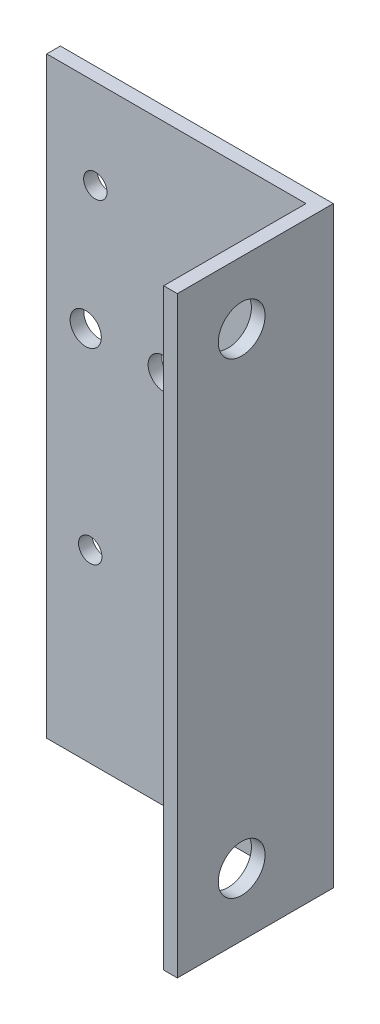
ISO-10303-21;
HEADER;
FILE_DESCRIPTION(('STEP AP214'),'2;1');
FILE_NAME('part.step','',(''),(''),'','','');
FILE_SCHEMA(('AUTOMOTIVE_DESIGN { 1 0 10303 214 1 1 1 1 }'));
ENDSEC;
DATA;
#1=APPLICATION_CONTEXT('core data for automotive mechanical design processes');
#2=APPLICATION_PROTOCOL_DEFINITION('international standard','automotive_design',2000,#1);
#3=PRODUCT_CONTEXT('',#1,'mechanical');
#4=PRODUCT('Part','Part','',(#3));
#5=PRODUCT_RELATED_PRODUCT_CATEGORY('part','',(#4));
#6=PRODUCT_DEFINITION_FORMATION('','',#4);
#7=PRODUCT_DEFINITION_CONTEXT('part definition',#1,'design');
#8=PRODUCT_DEFINITION('design','',#6,#7);
#9=PRODUCT_DEFINITION_SHAPE('','',#8);
#10=(LENGTH_UNIT() NAMED_UNIT(*) SI_UNIT(.MILLI.,.METRE.));
#11=(NAMED_UNIT(*) PLANE_ANGLE_UNIT() SI_UNIT($,.RADIAN.));
#12=(NAMED_UNIT(*) SI_UNIT($,.STERADIAN.) SOLID_ANGLE_UNIT());
#13=UNCERTAINTY_MEASURE_WITH_UNIT(LENGTH_MEASURE(1.E-05),#10,'distance_accuracy_value','');
#14=(GEOMETRIC_REPRESENTATION_CONTEXT(3) GLOBAL_UNCERTAINTY_ASSIGNED_CONTEXT((#13)) GLOBAL_UNIT_ASSIGNED_CONTEXT((#10,
#11,#12)) REPRESENTATION_CONTEXT('',''));
#15=CARTESIAN_POINT('',(0.,0.,0.));
#16=DIRECTION('',(0.,0.,1.));
#17=DIRECTION('',(1.,0.,0.));
#18=AXIS2_PLACEMENT_3D('',#15,#16,#17);
#19=CARTESIAN_POINT('',(0.,76.,-1.75));
#20=DIRECTION('',(-1.,0.,0.));
#21=DIRECTION('',(0.,0.,-1.));
#22=AXIS2_PLACEMENT_3D('',#19,#20,#21);
#23=PLANE('',#22);
#24=CARTESIAN_POINT('',(0.,67.9549999999984,9.99999999999945));
#25=DIRECTION('',(1.,0.,0.));
#26=DIRECTION('',(0.,0.,-1.));
#27=AXIS2_PLACEMENT_3D('',#24,#25,#26);
#28=CIRCLE('',#27,3.);
#29=CARTESIAN_POINT('',(0.,67.9549999999984,6.99999999999945));
#30=VERTEX_POINT('',#29);
#31=EDGE_CURVE('E151',#30,#30,#28,.F.);
#32=ORIENTED_EDGE('',*,*,#31,.T.);
#33=EDGE_LOOP('',(#32));
#34=FACE_BOUND('',#33,.T.);
#35=CARTESIAN_POINT('',(0.,8.05,9.99999999999945));
#36=DIRECTION('',(1.,0.,0.));
#37=DIRECTION('',(0.,0.,-1.));
#38=AXIS2_PLACEMENT_3D('',#35,#36,#37);
#39=CIRCLE('',#38,3.);
#40=CARTESIAN_POINT('',(0.,8.05,6.99999999999945));
#41=VERTEX_POINT('',#40);
#42=EDGE_CURVE('E121',#41,#41,#39,.F.);
#43=ORIENTED_EDGE('',*,*,#42,.T.);
#44=EDGE_LOOP('',(#43));
#45=FACE_BOUND('',#44,.T.);
#46=DIRECTION('',(0.,0.,1.));
#47=VECTOR('',#46,1.);
#48=CARTESIAN_POINT('',(0.,0.,-1.75));
#49=LINE('',#48,#47);
#50=CARTESIAN_POINT('',(0.,0.,-1.75));
#51=VERTEX_POINT('',#50);
#52=CARTESIAN_POINT('',(0.,0.,18.25));
#53=VERTEX_POINT('',#52);
#54=EDGE_CURVE('E118',#51,#53,#49,.T.);
#55=ORIENTED_EDGE('',*,*,#54,.F.);
#56=DIRECTION('',(0.,-1.,0.));
#57=VECTOR('',#56,1.);
#58=CARTESIAN_POINT('',(0.,76.,-1.75));
#59=LINE('',#58,#57);
#60=CARTESIAN_POINT('',(0.,76.,-1.75));
#61=VERTEX_POINT('',#60);
#62=EDGE_CURVE('E117',#61,#51,#59,.T.);
#63=ORIENTED_EDGE('',*,*,#62,.F.);
#64=DIRECTION('',(0.,0.,1.));
#65=VECTOR('',#64,1.);
#66=CARTESIAN_POINT('',(0.,76.,-1.75));
#67=LINE('',#66,#65);
#68=CARTESIAN_POINT('',(0.,76.,18.25));
#69=VERTEX_POINT('',#68);
#70=EDGE_CURVE('E131',#61,#69,#67,.T.);
#71=ORIENTED_EDGE('',*,*,#70,.T.);
#72=DIRECTION('',(0.,-1.,0.));
#73=VECTOR('',#72,1.);
#74=CARTESIAN_POINT('',(0.,76.,18.25));
#75=LINE('',#74,#73);
#76=EDGE_CURVE('E11',#69,#53,#75,.T.);
#77=ORIENTED_EDGE('',*,*,#76,.T.);
#78=EDGE_LOOP('',(#55,#63,#71,#77));
#79=FACE_BOUND('',#78,.T.);
#80=ADVANCED_FACE('F35',(#34,#45,#79),#23,.F.);
#81=CARTESIAN_POINT('',(-1.75,76.,18.25));
#82=DIRECTION('',(0.,0.,-1.));
#83=DIRECTION('',(1.,0.,0.));
#84=AXIS2_PLACEMENT_3D('',#81,#82,#83);
#85=PLANE('',#84);
#86=DIRECTION('',(-1.,0.,0.));
#87=VECTOR('',#86,1.);
#88=CARTESIAN_POINT('',(-1.75,0.,18.25));
#89=LINE('',#88,#87);
#90=CARTESIAN_POINT('',(-1.75,0.,18.25));
#91=VERTEX_POINT('',#90);
#92=EDGE_CURVE('E120',#53,#91,#89,.T.);
#93=ORIENTED_EDGE('',*,*,#92,.F.);
#94=ORIENTED_EDGE('',*,*,#76,.F.);
#95=DIRECTION('',(-1.,0.,0.));
#96=VECTOR('',#95,1.);
#97=CARTESIAN_POINT('',(-1.75,76.,18.25));
#98=LINE('',#97,#96);
#99=CARTESIAN_POINT('',(-1.75,76.,18.25));
#100=VERTEX_POINT('',#99);
#101=EDGE_CURVE('E83',#69,#100,#98,.T.);
#102=ORIENTED_EDGE('',*,*,#101,.T.);
#103=DIRECTION('',(0.,-1.,0.));
#104=VECTOR('',#103,1.);
#105=CARTESIAN_POINT('',(-1.75,76.,18.25));
#106=LINE('',#105,#104);
#107=EDGE_CURVE('E43',#100,#91,#106,.T.);
#108=ORIENTED_EDGE('',*,*,#107,.T.);
#109=EDGE_LOOP('',(#93,#94,#102,#108));
#110=FACE_BOUND('',#109,.T.);
#111=ADVANCED_FACE('F137',(#110),#85,.F.);
#112=CARTESIAN_POINT('',(-1.75,76.,18.25));
#113=DIRECTION('',(1.,0.,0.));
#114=DIRECTION('',(0.,0.,1.));
#115=AXIS2_PLACEMENT_3D('',#112,#113,#114);
#116=PLANE('',#115);
#117=CARTESIAN_POINT('',(-1.75,67.9549999999984,9.99999999999945));
#118=DIRECTION('',(1.,0.,0.));
#119=DIRECTION('',(0.,0.,-1.));
#120=AXIS2_PLACEMENT_3D('',#117,#118,#119);
#121=CIRCLE('',#120,3.);
#122=CARTESIAN_POINT('',(-1.75,67.9549999999984,6.99999999999945));
#123=VERTEX_POINT('',#122);
#124=EDGE_CURVE('E154',#123,#123,#121,.T.);
#125=ORIENTED_EDGE('',*,*,#124,.T.);
#126=EDGE_LOOP('',(#125));
#127=FACE_BOUND('',#126,.T.);
#128=CARTESIAN_POINT('',(-1.75,8.05,9.99999999999945));
#129=DIRECTION('',(1.,0.,0.));
#130=DIRECTION('',(0.,0.,-1.));
#131=AXIS2_PLACEMENT_3D('',#128,#129,#130);
#132=CIRCLE('',#131,3.);
#133=CARTESIAN_POINT('',(-1.75,8.05,6.99999999999945));
#134=VERTEX_POINT('',#133);
#135=EDGE_CURVE('E148',#134,#134,#132,.T.);
#136=ORIENTED_EDGE('',*,*,#135,.T.);
#137=EDGE_LOOP('',(#136));
#138=FACE_BOUND('',#137,.T.);
#139=DIRECTION('',(0.,0.,-1.));
#140=VECTOR('',#139,1.);
#141=CARTESIAN_POINT('',(-1.75,0.,18.25));
#142=LINE('',#141,#140);
#143=CARTESIAN_POINT('',(-1.75,0.,0.));
#144=VERTEX_POINT('',#143);
#145=EDGE_CURVE('E124',#91,#144,#142,.T.);
#146=ORIENTED_EDGE('',*,*,#145,.F.);
#147=ORIENTED_EDGE('',*,*,#107,.F.);
#148=DIRECTION('',(0.,0.,-1.));
#149=VECTOR('',#148,1.);
#150=CARTESIAN_POINT('',(-1.75,76.,18.25));
#151=LINE('',#150,#149);
#152=CARTESIAN_POINT('',(-1.75,76.,0.));
#153=VERTEX_POINT('',#152);
#154=EDGE_CURVE('E111',#100,#153,#151,.T.);
#155=ORIENTED_EDGE('',*,*,#154,.T.);
#156=DIRECTION('',(0.,-1.,0.));
#157=VECTOR('',#156,1.);
#158=CARTESIAN_POINT('',(-1.75,76.,0.));
#159=LINE('',#158,#157);
#160=EDGE_CURVE('E105',#153,#144,#159,.T.);
#161=ORIENTED_EDGE('',*,*,#160,.T.);
#162=EDGE_LOOP('',(#146,#147,#155,#161));
#163=FACE_BOUND('',#162,.T.);
#164=ADVANCED_FACE('F194',(#127,#138,#163),#116,.F.);
#165=CARTESIAN_POINT('',(-35.,76.,0.));
#166=DIRECTION('',(0.,0.,-1.));
#167=DIRECTION('',(1.,0.,0.));
#168=AXIS2_PLACEMENT_3D('',#165,#166,#167);
#169=PLANE('',#168);
#170=CARTESIAN_POINT('',(-20.,48.,0.));
#171=DIRECTION('',(0.,0.,1.));
#172=DIRECTION('',(1.,0.,0.));
#173=AXIS2_PLACEMENT_3D('',#170,#171,#172);
#174=CIRCLE('',#173,2.00000000000001);
#175=CARTESIAN_POINT('',(-18.,48.,0.));
#176=VERTEX_POINT('',#175);
#177=EDGE_CURVE('E175',#176,#176,#174,.F.);
#178=ORIENTED_EDGE('',*,*,#177,.T.);
#179=EDGE_LOOP('',(#178));
#180=FACE_BOUND('',#179,.T.);
#181=CARTESIAN_POINT('',(-30.,48.,0.));
#182=DIRECTION('',(0.,0.,1.));
#183=DIRECTION('',(1.,0.,0.));
#184=AXIS2_PLACEMENT_3D('',#181,#182,#183);
#185=CIRCLE('',#184,2.00000000000001);
#186=CARTESIAN_POINT('',(-28.,48.,0.));
#187=VERTEX_POINT('',#186);
#188=EDGE_CURVE('E169',#187,#187,#185,.F.);
#189=ORIENTED_EDGE('',*,*,#188,.T.);
#190=EDGE_LOOP('',(#189));
#191=FACE_BOUND('',#190,.T.);
#192=CARTESIAN_POINT('',(-29.41701924,23.7,0.));
#193=DIRECTION('',(0.,0.,1.));
#194=DIRECTION('',(1.,0.,0.));
#195=AXIS2_PLACEMENT_3D('',#192,#193,#194);
#196=CIRCLE('',#195,1.5);
#197=CARTESIAN_POINT('',(-27.91701924,23.7,0.));
#198=VERTEX_POINT('',#197);
#199=EDGE_CURVE('E163',#198,#198,#196,.F.);
#200=ORIENTED_EDGE('',*,*,#199,.T.);
#201=EDGE_LOOP('',(#200));
#202=FACE_BOUND('',#201,.T.);
#203=CARTESIAN_POINT('',(-28.76701924,64.5,0.));
#204=DIRECTION('',(0.,0.,1.));
#205=DIRECTION('',(1.,0.,0.));
#206=AXIS2_PLACEMENT_3D('',#203,#204,#205);
#207=CIRCLE('',#206,1.5);
#208=CARTESIAN_POINT('',(-27.26701924,64.5,0.));
#209=VERTEX_POINT('',#208);
#210=EDGE_CURVE('E157',#209,#209,#207,.F.);
#211=ORIENTED_EDGE('',*,*,#210,.T.);
#212=EDGE_LOOP('',(#211));
#213=FACE_BOUND('',#212,.T.);
#214=DIRECTION('',(-1.,0.,0.));
#215=VECTOR('',#214,1.);
#216=CARTESIAN_POINT('',(-35.,0.,0.));
#217=LINE('',#216,#215);
#218=CARTESIAN_POINT('',(-35.,0.,0.));
#219=VERTEX_POINT('',#218);
#220=EDGE_CURVE('E127',#144,#219,#217,.T.);
#221=ORIENTED_EDGE('',*,*,#220,.F.);
#222=ORIENTED_EDGE('',*,*,#160,.F.);
#223=DIRECTION('',(-1.,0.,0.));
#224=VECTOR('',#223,1.);
#225=CARTESIAN_POINT('',(-35.,76.,0.));
#226=LINE('',#225,#224);
#227=CARTESIAN_POINT('',(-35.,76.,0.));
#228=VERTEX_POINT('',#227);
#229=EDGE_CURVE('E95',#153,#228,#226,.T.);
#230=ORIENTED_EDGE('',*,*,#229,.T.);
#231=DIRECTION('',(0.,-1.,0.));
#232=VECTOR('',#231,1.);
#233=CARTESIAN_POINT('',(-35.,76.,0.));
#234=LINE('',#233,#232);
#235=EDGE_CURVE('E100',#228,#219,#234,.T.);
#236=ORIENTED_EDGE('',*,*,#235,.T.);
#237=EDGE_LOOP('',(#221,#222,#230,#236));
#238=FACE_BOUND('',#237,.T.);
#239=ADVANCED_FACE('F108',(#180,#191,#202,#213,#238),#169,.F.);
#240=CARTESIAN_POINT('',(-35.,76.,0.));
#241=DIRECTION('',(1.,0.,0.));
#242=DIRECTION('',(0.,0.,1.));
#243=AXIS2_PLACEMENT_3D('',#240,#241,#242);
#244=PLANE('',#243);
#245=DIRECTION('',(0.,0.,-1.));
#246=VECTOR('',#245,1.);
#247=CARTESIAN_POINT('',(-35.,0.,0.));
#248=LINE('',#247,#246);
#249=CARTESIAN_POINT('',(-35.,0.,-1.75));
#250=VERTEX_POINT('',#249);
#251=EDGE_CURVE('E102',#219,#250,#248,.T.);
#252=ORIENTED_EDGE('',*,*,#251,.F.);
#253=ORIENTED_EDGE('',*,*,#235,.F.);
#254=DIRECTION('',(0.,0.,-1.));
#255=VECTOR('',#254,1.);
#256=CARTESIAN_POINT('',(-35.,76.,0.));
#257=LINE('',#256,#255);
#258=CARTESIAN_POINT('',(-35.,76.,-1.75));
#259=VERTEX_POINT('',#258);
#260=EDGE_CURVE('E91',#228,#259,#257,.T.);
#261=ORIENTED_EDGE('',*,*,#260,.T.);
#262=DIRECTION('',(0.,-1.,0.));
#263=VECTOR('',#262,1.);
#264=CARTESIAN_POINT('',(-35.,76.,-1.75));
#265=LINE('',#264,#263);
#266=EDGE_CURVE('E106',#259,#250,#265,.T.);
#267=ORIENTED_EDGE('',*,*,#266,.T.);
#268=EDGE_LOOP('',(#252,#253,#261,#267));
#269=FACE_BOUND('',#268,.T.);
#270=ADVANCED_FACE('F101',(#269),#244,.F.);
#271=CARTESIAN_POINT('',(0.,76.,-1.75));
#272=DIRECTION('',(0.,0.,1.));
#273=DIRECTION('',(-1.,0.,0.));
#274=AXIS2_PLACEMENT_3D('',#271,#272,#273);
#275=PLANE('',#274);
#276=CARTESIAN_POINT('',(-20.,48.,-1.75));
#277=DIRECTION('',(0.,0.,1.));
#278=DIRECTION('',(1.,0.,0.));
#279=AXIS2_PLACEMENT_3D('',#276,#277,#278);
#280=CIRCLE('',#279,2.00000000000001);
#281=CARTESIAN_POINT('',(-18.,48.,-1.75));
#282=VERTEX_POINT('',#281);
#283=EDGE_CURVE('E178',#282,#282,#280,.T.);
#284=ORIENTED_EDGE('',*,*,#283,.T.);
#285=EDGE_LOOP('',(#284));
#286=FACE_BOUND('',#285,.T.);
#287=CARTESIAN_POINT('',(-30.,48.,-1.75));
#288=DIRECTION('',(0.,0.,1.));
#289=DIRECTION('',(1.,0.,0.));
#290=AXIS2_PLACEMENT_3D('',#287,#288,#289);
#291=CIRCLE('',#290,2.00000000000001);
#292=CARTESIAN_POINT('',(-28.,48.,-1.75));
#293=VERTEX_POINT('',#292);
#294=EDGE_CURVE('E172',#293,#293,#291,.T.);
#295=ORIENTED_EDGE('',*,*,#294,.T.);
#296=EDGE_LOOP('',(#295));
#297=FACE_BOUND('',#296,.T.);
#298=CARTESIAN_POINT('',(-29.41701924,23.7,-1.75));
#299=DIRECTION('',(0.,0.,1.));
#300=DIRECTION('',(1.,0.,0.));
#301=AXIS2_PLACEMENT_3D('',#298,#299,#300);
#302=CIRCLE('',#301,1.5);
#303=CARTESIAN_POINT('',(-27.91701924,23.7,-1.75));
#304=VERTEX_POINT('',#303);
#305=EDGE_CURVE('E166',#304,#304,#302,.T.);
#306=ORIENTED_EDGE('',*,*,#305,.T.);
#307=EDGE_LOOP('',(#306));
#308=FACE_BOUND('',#307,.T.);
#309=CARTESIAN_POINT('',(-28.76701924,64.5,-1.75));
#310=DIRECTION('',(0.,0.,1.));
#311=DIRECTION('',(1.,0.,0.));
#312=AXIS2_PLACEMENT_3D('',#309,#310,#311);
#313=CIRCLE('',#312,1.5);
#314=CARTESIAN_POINT('',(-27.26701924,64.5,-1.75));
#315=VERTEX_POINT('',#314);
#316=EDGE_CURVE('E160',#315,#315,#313,.T.);
#317=ORIENTED_EDGE('',*,*,#316,.T.);
#318=EDGE_LOOP('',(#317));
#319=FACE_BOUND('',#318,.T.);
#320=DIRECTION('',(1.,0.,0.));
#321=VECTOR('',#320,1.);
#322=CARTESIAN_POINT('',(0.,0.,-1.75));
#323=LINE('',#322,#321);
#324=EDGE_CURVE('E71',#250,#51,#323,.T.);
#325=ORIENTED_EDGE('',*,*,#324,.F.);
#326=ORIENTED_EDGE('',*,*,#266,.F.);
#327=DIRECTION('',(1.,0.,0.));
#328=VECTOR('',#327,1.);
#329=CARTESIAN_POINT('',(0.,76.,-1.75));
#330=LINE('',#329,#328);
#331=EDGE_CURVE('E51',#259,#61,#330,.T.);
#332=ORIENTED_EDGE('',*,*,#331,.T.);
#333=ORIENTED_EDGE('',*,*,#62,.T.);
#334=EDGE_LOOP('',(#325,#326,#332,#333));
#335=FACE_BOUND('',#334,.T.);
#336=ADVANCED_FACE('F182',(#286,#297,#308,#319,#335),#275,.F.);
#337=CARTESIAN_POINT('',(0.,76.,0.));
#338=DIRECTION('',(0.,-1.,0.));
#339=DIRECTION('',(0.,0.,1.));
#340=AXIS2_PLACEMENT_3D('',#337,#338,#339);
#341=PLANE('',#340);
#342=ORIENTED_EDGE('',*,*,#70,.F.);
#343=ORIENTED_EDGE('',*,*,#331,.F.);
#344=ORIENTED_EDGE('',*,*,#260,.F.);
#345=ORIENTED_EDGE('',*,*,#229,.F.);
#346=ORIENTED_EDGE('',*,*,#154,.F.);
#347=ORIENTED_EDGE('',*,*,#101,.F.);
#348=EDGE_LOOP('',(#342,#343,#344,#345,#346,#347));
#349=FACE_BOUND('',#348,.T.);
#350=ADVANCED_FACE('F93',(#349),#341,.F.);
#351=CARTESIAN_POINT('',(0.,0.,0.));
#352=DIRECTION('',(0.,-1.,0.));
#353=DIRECTION('',(0.,0.,1.));
#354=AXIS2_PLACEMENT_3D('',#351,#352,#353);
#355=PLANE('',#354);
#356=ORIENTED_EDGE('',*,*,#54,.T.);
#357=ORIENTED_EDGE('',*,*,#92,.T.);
#358=ORIENTED_EDGE('',*,*,#145,.T.);
#359=ORIENTED_EDGE('',*,*,#220,.T.);
#360=ORIENTED_EDGE('',*,*,#251,.T.);
#361=ORIENTED_EDGE('',*,*,#324,.T.);
#362=EDGE_LOOP('',(#356,#357,#358,#359,#360,#361));
#363=FACE_BOUND('',#362,.T.);
#364=ADVANCED_FACE('F139',(#363),#355,.T.);
#365=CARTESIAN_POINT('',(0.000999999999999916,8.05,9.99999999999945));
#366=DIRECTION('',(-1.,0.,0.));
#367=DIRECTION('',(0.,0.,-1.));
#368=AXIS2_PLACEMENT_3D('',#365,#366,#367);
#369=CYLINDRICAL_SURFACE('',#368,3.);
#370=ORIENTED_EDGE('',*,*,#135,.F.);
#371=EDGE_LOOP('',(#370));
#372=FACE_BOUND('',#371,.T.);
#373=ORIENTED_EDGE('',*,*,#42,.F.);
#374=EDGE_LOOP('',(#373));
#375=FACE_BOUND('',#374,.T.);
#376=ADVANCED_FACE('F214',(#372,#375),#369,.F.);
#377=CARTESIAN_POINT('',(0.000999999999999916,67.9549999999984,9.99999999999945));
#378=DIRECTION('',(-1.,0.,0.));
#379=DIRECTION('',(0.,0.,-1.));
#380=AXIS2_PLACEMENT_3D('',#377,#378,#379);
#381=CYLINDRICAL_SURFACE('',#380,3.);
#382=ORIENTED_EDGE('',*,*,#124,.F.);
#383=EDGE_LOOP('',(#382));
#384=FACE_BOUND('',#383,.T.);
#385=ORIENTED_EDGE('',*,*,#31,.F.);
#386=EDGE_LOOP('',(#385));
#387=FACE_BOUND('',#386,.T.);
#388=ADVANCED_FACE('F205',(#384,#387),#381,.F.);
#389=CARTESIAN_POINT('',(-28.76701924,64.5,18.251));
#390=DIRECTION('',(0.,0.,-1.));
#391=DIRECTION('',(1.,0.,0.));
#392=AXIS2_PLACEMENT_3D('',#389,#390,#391);
#393=CYLINDRICAL_SURFACE('',#392,1.5);
#394=ORIENTED_EDGE('',*,*,#316,.F.);
#395=EDGE_LOOP('',(#394));
#396=FACE_BOUND('',#395,.T.);
#397=ORIENTED_EDGE('',*,*,#210,.F.);
#398=EDGE_LOOP('',(#397));
#399=FACE_BOUND('',#398,.T.);
#400=ADVANCED_FACE('F202',(#396,#399),#393,.F.);
#401=CARTESIAN_POINT('',(-29.41701924,23.7,18.251));
#402=DIRECTION('',(0.,0.,-1.));
#403=DIRECTION('',(1.,0.,0.));
#404=AXIS2_PLACEMENT_3D('',#401,#402,#403);
#405=CYLINDRICAL_SURFACE('',#404,1.5);
#406=ORIENTED_EDGE('',*,*,#305,.F.);
#407=EDGE_LOOP('',(#406));
#408=FACE_BOUND('',#407,.T.);
#409=ORIENTED_EDGE('',*,*,#199,.F.);
#410=EDGE_LOOP('',(#409));
#411=FACE_BOUND('',#410,.T.);
#412=ADVANCED_FACE('F204',(#408,#411),#405,.F.);
#413=CARTESIAN_POINT('',(-30.,48.,18.251));
#414=DIRECTION('',(0.,0.,-1.));
#415=DIRECTION('',(1.,0.,0.));
#416=AXIS2_PLACEMENT_3D('',#413,#414,#415);
#417=CYLINDRICAL_SURFACE('',#416,2.00000000000001);
#418=ORIENTED_EDGE('',*,*,#294,.F.);
#419=EDGE_LOOP('',(#418));
#420=FACE_BOUND('',#419,.T.);
#421=ORIENTED_EDGE('',*,*,#188,.F.);
#422=EDGE_LOOP('',(#421));
#423=FACE_BOUND('',#422,.T.);
#424=ADVANCED_FACE('F188',(#420,#423),#417,.F.);
#425=CARTESIAN_POINT('',(-20.,48.,18.251));
#426=DIRECTION('',(0.,0.,-1.));
#427=DIRECTION('',(1.,0.,0.));
#428=AXIS2_PLACEMENT_3D('',#425,#426,#427);
#429=CYLINDRICAL_SURFACE('',#428,2.00000000000001);
#430=ORIENTED_EDGE('',*,*,#283,.F.);
#431=EDGE_LOOP('',(#430));
#432=FACE_BOUND('',#431,.T.);
#433=ORIENTED_EDGE('',*,*,#177,.F.);
#434=EDGE_LOOP('',(#433));
#435=FACE_BOUND('',#434,.T.);
#436=ADVANCED_FACE('F185',(#432,#435),#429,.F.);
#437=CLOSED_SHELL('',(#80,#111,#164,#239,#270,#336,#350,#364,#376,#388,#400,#412,#424,#436));
#438=MANIFOLD_SOLID_BREP('B2',#437);
#439=ADVANCED_BREP_SHAPE_REPRESENTATION('',(#18,#438),#14);
#440=SHAPE_DEFINITION_REPRESENTATION(#9,#439);
ENDSEC;
END-ISO-10303-21;
